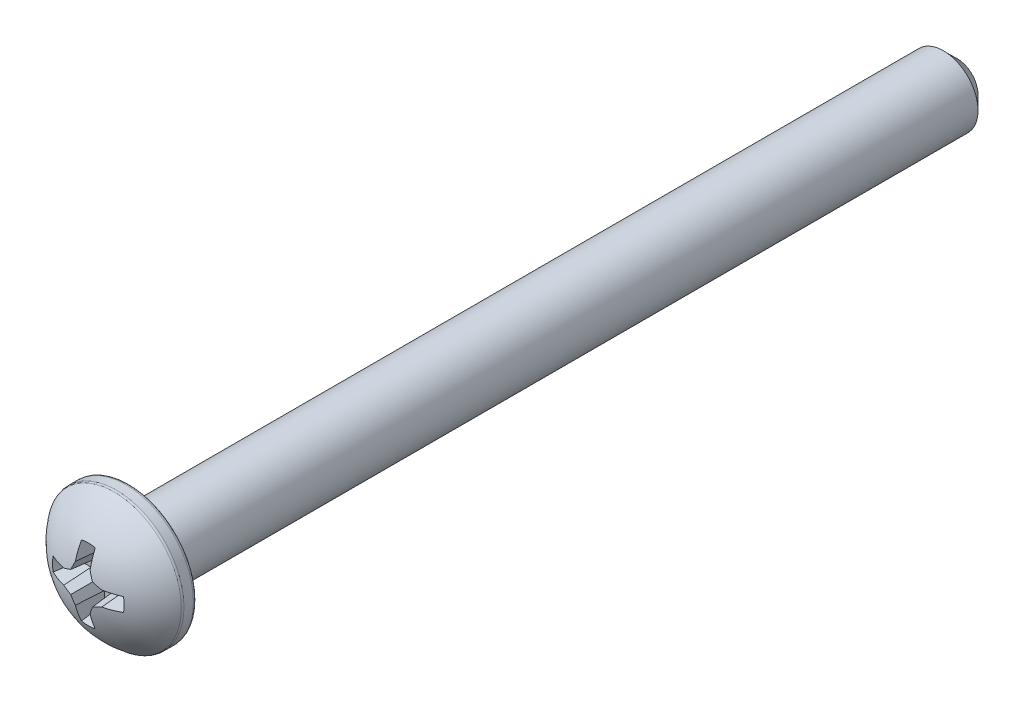
ISO-10303-21;
HEADER;
FILE_DESCRIPTION(('STEP AP214'),'2;1');
FILE_NAME('part.step','',(''),(''),'','','');
FILE_SCHEMA(('AUTOMOTIVE_DESIGN { 1 0 10303 214 1 1 1 1 }'));
ENDSEC;
DATA;
#1=APPLICATION_CONTEXT('core data for automotive mechanical design processes');
#2=APPLICATION_PROTOCOL_DEFINITION('international standard','automotive_design',2000,#1);
#3=PRODUCT_CONTEXT('',#1,'mechanical');
#4=PRODUCT('Part','Part','',(#3));
#5=PRODUCT_RELATED_PRODUCT_CATEGORY('part','',(#4));
#6=PRODUCT_DEFINITION_FORMATION('','',#4);
#7=PRODUCT_DEFINITION_CONTEXT('part definition',#1,'design');
#8=PRODUCT_DEFINITION('design','',#6,#7);
#9=PRODUCT_DEFINITION_SHAPE('','',#8);
#10=(LENGTH_UNIT() NAMED_UNIT(*) SI_UNIT(.MILLI.,.METRE.));
#11=(NAMED_UNIT(*) PLANE_ANGLE_UNIT() SI_UNIT($,.RADIAN.));
#12=(NAMED_UNIT(*) SI_UNIT($,.STERADIAN.) SOLID_ANGLE_UNIT());
#13=UNCERTAINTY_MEASURE_WITH_UNIT(LENGTH_MEASURE(1.E-05),#10,'distance_accuracy_value','');
#14=(GEOMETRIC_REPRESENTATION_CONTEXT(3) GLOBAL_UNCERTAINTY_ASSIGNED_CONTEXT((#13)) GLOBAL_UNIT_ASSIGNED_CONTEXT((#10,
#11,#12)) REPRESENTATION_CONTEXT('',''));
#15=CARTESIAN_POINT('',(0.,0.,0.));
#16=DIRECTION('',(0.,0.,1.));
#17=DIRECTION('',(1.,0.,0.));
#18=AXIS2_PLACEMENT_3D('',#15,#16,#17);
#19=CARTESIAN_POINT('',(0.,0.,-20.1803));
#20=DIRECTION('',(0.,0.,1.));
#21=DIRECTION('',(1.,0.,0.));
#22=AXIS2_PLACEMENT_3D('',#19,#20,#21);
#23=PLANE('',#22);
#24=CARTESIAN_POINT('',(0.,0.,-20.1803));
#25=DIRECTION('',(0.,0.,1.));
#26=DIRECTION('',(1.,0.,0.));
#27=AXIS2_PLACEMENT_3D('',#24,#25,#26);
#28=CIRCLE('',#27,0.952500000000011);
#29=CARTESIAN_POINT('',(0.952500000000011,0.,-20.1803));
#30=VERTEX_POINT('',#29);
#31=EDGE_CURVE('E510',#30,#30,#28,.T.);
#32=ORIENTED_EDGE('',*,*,#31,.F.);
#33=EDGE_LOOP('',(#32));
#34=FACE_BOUND('',#33,.T.);
#35=ADVANCED_FACE('F39',(#34),#23,.F.);
#36=CARTESIAN_POINT('',(0.,0.,-20.1803));
#37=DIRECTION('',(0.,0.,1.));
#38=DIRECTION('',(1.,0.,0.));
#39=AXIS2_PLACEMENT_3D('',#36,#37,#38);
#40=CONICAL_SURFACE('',#39,0.952500000000011,0.785398163397444);
#41=CARTESIAN_POINT('',(0.,0.,-19.5453));
#42=DIRECTION('',(0.,0.,1.));
#43=DIRECTION('',(1.,0.,0.));
#44=AXIS2_PLACEMENT_3D('',#41,#42,#43);
#45=CIRCLE('',#44,1.5875);
#46=CARTESIAN_POINT('',(1.5875,0.,-19.5453));
#47=VERTEX_POINT('',#46);
#48=EDGE_CURVE('E512',#47,#47,#45,.T.);
#49=ORIENTED_EDGE('',*,*,#48,.F.);
#50=EDGE_LOOP('',(#49));
#51=FACE_BOUND('',#50,.T.);
#52=ORIENTED_EDGE('',*,*,#31,.T.);
#53=EDGE_LOOP('',(#52));
#54=FACE_BOUND('',#53,.T.);
#55=ADVANCED_FACE('F380',(#51,#54),#40,.T.);
#56=CARTESIAN_POINT('',(0.,0.,20.1803));
#57=DIRECTION('',(0.,0.,1.));
#58=DIRECTION('',(1.,0.,0.));
#59=AXIS2_PLACEMENT_3D('',#56,#57,#58);
#60=CYLINDRICAL_SURFACE('',#59,1.5875);
#61=CARTESIAN_POINT('',(0.,0.,17.9197));
#62=DIRECTION('',(0.,0.,1.));
#63=DIRECTION('',(1.,0.,0.));
#64=AXIS2_PLACEMENT_3D('',#61,#62,#63);
#65=CIRCLE('',#64,1.5875);
#66=CARTESIAN_POINT('',(1.5875,0.,17.9197));
#67=VERTEX_POINT('',#66);
#68=EDGE_CURVE('E515',#67,#67,#65,.T.);
#69=ORIENTED_EDGE('',*,*,#68,.F.);
#70=EDGE_LOOP('',(#69));
#71=FACE_BOUND('',#70,.T.);
#72=ORIENTED_EDGE('',*,*,#48,.T.);
#73=EDGE_LOOP('',(#72));
#74=FACE_BOUND('',#73,.T.);
#75=ADVANCED_FACE('F385',(#71,#74),#60,.T.);
#76=CARTESIAN_POINT('',(0.,1.5875,17.9197));
#77=DIRECTION('',(0.,0.,1.));
#78=DIRECTION('',(1.,0.,0.));
#79=AXIS2_PLACEMENT_3D('',#76,#77,#78);
#80=PLANE('',#79);
#81=CARTESIAN_POINT('',(0.,0.,17.9197));
#82=DIRECTION('',(0.,0.,1.));
#83=DIRECTION('',(1.,0.,0.));
#84=AXIS2_PLACEMENT_3D('',#81,#82,#83);
#85=CIRCLE('',#84,2.95002857142858);
#86=CARTESIAN_POINT('',(2.95002857142858,0.,17.9197));
#87=VERTEX_POINT('',#86);
#88=EDGE_CURVE('E520',#87,#87,#85,.T.);
#89=ORIENTED_EDGE('',*,*,#88,.F.);
#90=EDGE_LOOP('',(#89));
#91=FACE_BOUND('',#90,.T.);
#92=ORIENTED_EDGE('',*,*,#68,.T.);
#93=EDGE_LOOP('',(#92));
#94=FACE_BOUND('',#93,.T.);
#95=ADVANCED_FACE('F392',(#91,#94),#80,.F.);
#96=CARTESIAN_POINT('',(0.,0.,18.0811714285714));
#97=DIRECTION('',(0.,0.,1.));
#98=DIRECTION('',(1.,0.,0.));
#99=AXIS2_PLACEMENT_3D('',#96,#97,#98);
#100=TOROIDAL_SURFACE('',#99,2.95002857142858,0.161471428571425);
#101=CARTESIAN_POINT('',(0.,0.,18.0811714285714));
#102=DIRECTION('',(0.,0.,1.));
#103=DIRECTION('',(1.,0.,0.));
#104=AXIS2_PLACEMENT_3D('',#101,#102,#103);
#105=CIRCLE('',#104,3.1115);
#106=CARTESIAN_POINT('',(3.1115,0.,18.0811714285714));
#107=VERTEX_POINT('',#106);
#108=EDGE_CURVE('E523',#107,#107,#105,.T.);
#109=ORIENTED_EDGE('',*,*,#108,.F.);
#110=EDGE_LOOP('',(#109));
#111=FACE_BOUND('',#110,.T.);
#112=ORIENTED_EDGE('',*,*,#88,.T.);
#113=EDGE_LOOP('',(#112));
#114=FACE_BOUND('',#113,.T.);
#115=ADVANCED_FACE('F396',(#111,#114),#100,.T.);
#116=CARTESIAN_POINT('',(0.,0.,20.1803));
#117=DIRECTION('',(0.,0.,1.));
#118=DIRECTION('',(1.,0.,0.));
#119=AXIS2_PLACEMENT_3D('',#116,#117,#118);
#120=CYLINDRICAL_SURFACE('',#119,3.1115);
#121=CARTESIAN_POINT('',(0.,0.,18.5138366678697));
#122=DIRECTION('',(0.,0.,1.));
#123=DIRECTION('',(1.,0.,0.));
#124=AXIS2_PLACEMENT_3D('',#121,#122,#123);
#125=CIRCLE('',#124,3.1115);
#126=CARTESIAN_POINT('',(3.1115,0.,18.5138366678697));
#127=VERTEX_POINT('',#126);
#128=EDGE_CURVE('E526',#127,#127,#125,.T.);
#129=ORIENTED_EDGE('',*,*,#128,.F.);
#130=EDGE_LOOP('',(#129));
#131=FACE_BOUND('',#130,.T.);
#132=ORIENTED_EDGE('',*,*,#108,.T.);
#133=EDGE_LOOP('',(#132));
#134=FACE_BOUND('',#133,.T.);
#135=ADVANCED_FACE('F400',(#131,#134),#120,.T.);
#136=CARTESIAN_POINT('',(0.,0.,18.5138366678697));
#137=DIRECTION('',(0.,0.,1.));
#138=DIRECTION('',(1.,0.,0.));
#139=AXIS2_PLACEMENT_3D('',#136,#137,#138);
#140=TOROIDAL_SURFACE('',#139,2.95002857142858,0.161471428571425);
#141=CARTESIAN_POINT('',(0.,0.,18.6086151864584));
#142=DIRECTION('',(0.,0.,1.));
#143=DIRECTION('',(1.,0.,0.));
#144=AXIS2_PLACEMENT_3D('',#141,#142,#143);
#145=CIRCLE('',#144,3.08075750724245);
#146=CARTESIAN_POINT('',(3.08075750724245,0.,18.6086151864584));
#147=VERTEX_POINT('',#146);
#148=EDGE_CURVE('E217',#147,#147,#145,.T.);
#149=ORIENTED_EDGE('',*,*,#148,.F.);
#150=EDGE_LOOP('',(#149));
#151=FACE_BOUND('',#150,.T.);
#152=ORIENTED_EDGE('',*,*,#128,.T.);
#153=EDGE_LOOP('',(#152));
#154=FACE_BOUND('',#153,.T.);
#155=ADVANCED_FACE('F404',(#151,#154),#140,.T.);
#156=CARTESIAN_POINT('',(0.,0.,16.3750650481541));
#157=DIRECTION('',(0.,0.,1.));
#158=DIRECTION('',(0.,1.,0.));
#159=AXIS2_PLACEMENT_3D('',#156,#157,#158);
#160=SPHERICAL_SURFACE('',#159,3.8052349518459);
#161=CARTESIAN_POINT('',(0.,0.0169552992858579,16.3735816516799));
#162=DIRECTION('',(0.,-0.996194698091746,0.0871557427476584));
#163=DIRECTION('',(0.,-0.0871557427476584,-0.996194698091746));
#164=AXIS2_PLACEMENT_3D('',#161,#162,#163);
#165=CIRCLE('',#164,3.80519688795609);
#166=CARTESIAN_POINT('',(-1.6184832889578,0.317105748256313,19.8043169821095));
#167=VERTEX_POINT('',#166);
#168=CARTESIAN_POINT('',(-0.872962105006004,0.339754810015824,20.0631969426292));
#169=VERTEX_POINT('',#168);
#170=EDGE_CURVE('E230',#167,#169,#165,.F.);
#171=ORIENTED_EDGE('',*,*,#170,.T.);
#172=CARTESIAN_POINT('',(-0.123537853912349,0.298246762381666,16.3468219604749));
#173=DIRECTION('',(0.381227206369648,-0.920363891963227,0.0871557427476584));
#174=DIRECTION('',(0.923879532511289,0.382683432365084,0.));
#175=AXIS2_PLACEMENT_3D('',#172,#173,#174);
#176=CIRCLE('',#175,3.79141169409596);
#177=CARTESIAN_POINT('',(-0.499342790609114,0.499342790609112,20.1141995193497));
#178=VERTEX_POINT('',#177);
#179=EDGE_CURVE('E11',#169,#178,#176,.F.);
#180=ORIENTED_EDGE('',*,*,#179,.T.);
#181=CARTESIAN_POINT('',(-0.298246762381666,0.12353785391235,16.3468219604749));
#182=DIRECTION('',(0.920363891963228,-0.381227206369646,0.0871557427476584));
#183=DIRECTION('',(0.382683432365082,0.92387953251129,0.));
#184=AXIS2_PLACEMENT_3D('',#181,#182,#183);
#185=CIRCLE('',#184,3.79141169409596);
#186=CARTESIAN_POINT('',(-0.339754810015826,0.872962105006002,20.0631969426292));
#187=VERTEX_POINT('',#186);
#188=EDGE_CURVE('E49',#178,#187,#185,.F.);
#189=ORIENTED_EDGE('',*,*,#188,.T.);
#190=CARTESIAN_POINT('',(-0.0169552992858607,0.,16.3735816516799));
#191=DIRECTION('',(0.996194698091746,0.,0.0871557427476584));
#192=DIRECTION('',(0.0871557427476584,0.,-0.996194698091746));
#193=AXIS2_PLACEMENT_3D('',#190,#191,#192);
#194=CIRCLE('',#193,3.80519688795609);
#195=CARTESIAN_POINT('',(-0.317105748256316,1.6184832889578,19.8043169821095));
#196=VERTEX_POINT('',#195);
#197=EDGE_CURVE('E342',#187,#196,#194,.F.);
#198=ORIENTED_EDGE('',*,*,#197,.T.);
#199=CARTESIAN_POINT('',(0.,0.,19.8043169821095));
#200=DIRECTION('',(0.,0.,-1.));
#201=DIRECTION('',(-1.,0.,0.));
#202=AXIS2_PLACEMENT_3D('',#199,#200,#201);
#203=CIRCLE('',#202,1.64925565398844);
#204=CARTESIAN_POINT('',(0.317105748256316,1.6184832889578,19.8043169821095));
#205=VERTEX_POINT('',#204);
#206=EDGE_CURVE('E341',#196,#205,#203,.T.);
#207=ORIENTED_EDGE('',*,*,#206,.T.);
#208=CARTESIAN_POINT('',(0.0169552992858607,0.,16.3735816516799));
#209=DIRECTION('',(-0.996194698091746,0.,0.0871557427476584));
#210=DIRECTION('',(0.0871557427476584,0.,0.996194698091746));
#211=AXIS2_PLACEMENT_3D('',#208,#209,#210);
#212=CIRCLE('',#211,3.80519688795609);
#213=CARTESIAN_POINT('',(0.339754810015826,0.872962105006002,20.0631969426292));
#214=VERTEX_POINT('',#213);
#215=EDGE_CURVE('E186',#205,#214,#212,.F.);
#216=ORIENTED_EDGE('',*,*,#215,.T.);
#217=CARTESIAN_POINT('',(0.298246762381666,0.12353785391235,16.3468219604749));
#218=DIRECTION('',(-0.920363891963228,-0.381227206369646,0.0871557427476584));
#219=DIRECTION('',(0.382683432365082,-0.92387953251129,0.));
#220=AXIS2_PLACEMENT_3D('',#217,#218,#219);
#221=CIRCLE('',#220,3.79141169409596);
#222=CARTESIAN_POINT('',(0.499342790609114,0.499342790609112,20.1141995193497));
#223=VERTEX_POINT('',#222);
#224=EDGE_CURVE('E478',#214,#223,#221,.F.);
#225=ORIENTED_EDGE('',*,*,#224,.T.);
#226=CARTESIAN_POINT('',(0.123537853912349,0.298246762381666,16.3468219604749));
#227=DIRECTION('',(-0.381227206369648,-0.920363891963227,0.0871557427476584));
#228=DIRECTION('',(0.923879532511289,-0.382683432365084,0.));
#229=AXIS2_PLACEMENT_3D('',#226,#227,#228);
#230=CIRCLE('',#229,3.79141169409596);
#231=CARTESIAN_POINT('',(0.872962105006004,0.339754810015824,20.0631969426292));
#232=VERTEX_POINT('',#231);
#233=EDGE_CURVE('E476',#223,#232,#230,.F.);
#234=ORIENTED_EDGE('',*,*,#233,.T.);
#235=CARTESIAN_POINT('',(0.,0.0169552992858579,16.3735816516799));
#236=DIRECTION('',(0.,-0.996194698091746,0.0871557427476584));
#237=DIRECTION('',(0.,-0.0871557427476584,-0.996194698091746));
#238=AXIS2_PLACEMENT_3D('',#235,#236,#237);
#239=CIRCLE('',#238,3.80519688795609);
#240=CARTESIAN_POINT('',(1.6184832889578,0.317105748256313,19.8043169821095));
#241=VERTEX_POINT('',#240);
#242=EDGE_CURVE('E475',#232,#241,#239,.F.);
#243=ORIENTED_EDGE('',*,*,#242,.T.);
#244=CARTESIAN_POINT('',(0.,0.,19.8043169821095));
#245=DIRECTION('',(0.,0.,-1.));
#246=DIRECTION('',(-1.,0.,0.));
#247=AXIS2_PLACEMENT_3D('',#244,#245,#246);
#248=CIRCLE('',#247,1.64925565398844);
#249=CARTESIAN_POINT('',(1.6184832889578,-0.317105748256313,19.8043169821095));
#250=VERTEX_POINT('',#249);
#251=EDGE_CURVE('E291',#241,#250,#248,.T.);
#252=ORIENTED_EDGE('',*,*,#251,.T.);
#253=CARTESIAN_POINT('',(0.,-0.0169552992858579,16.3735816516799));
#254=DIRECTION('',(0.,0.996194698091746,0.0871557427476584));
#255=DIRECTION('',(0.,-0.0871557427476584,0.996194698091746));
#256=AXIS2_PLACEMENT_3D('',#253,#254,#255);
#257=CIRCLE('',#256,3.80519688795609);
#258=CARTESIAN_POINT('',(0.872962105006004,-0.339754810015824,20.0631969426292));
#259=VERTEX_POINT('',#258);
#260=EDGE_CURVE('E288',#250,#259,#257,.F.);
#261=ORIENTED_EDGE('',*,*,#260,.T.);
#262=CARTESIAN_POINT('',(0.12353785391235,-0.298246762381665,16.3468219604749));
#263=DIRECTION('',(-0.381227206369648,0.920363891963227,0.0871557427476584));
#264=DIRECTION('',(-0.923879532511289,-0.382683432365084,0.));
#265=AXIS2_PLACEMENT_3D('',#262,#263,#264);
#266=CIRCLE('',#265,3.79141169409596);
#267=CARTESIAN_POINT('',(0.499342790609114,-0.499342790609112,20.1141995193497));
#268=VERTEX_POINT('',#267);
#269=EDGE_CURVE('E292',#259,#268,#266,.F.);
#270=ORIENTED_EDGE('',*,*,#269,.T.);
#271=CARTESIAN_POINT('',(0.298246762381667,-0.123537853912348,16.3468219604749));
#272=DIRECTION('',(-0.920363891963228,0.381227206369646,0.0871557427476584));
#273=DIRECTION('',(-0.382683432365082,-0.92387953251129,0.));
#274=AXIS2_PLACEMENT_3D('',#271,#272,#273);
#275=CIRCLE('',#274,3.79141169409596);
#276=CARTESIAN_POINT('',(0.339754810015826,-0.872962105006002,20.0631969426292));
#277=VERTEX_POINT('',#276);
#278=EDGE_CURVE('E295',#268,#277,#275,.F.);
#279=ORIENTED_EDGE('',*,*,#278,.T.);
#280=CARTESIAN_POINT('',(0.0169552992858607,0.,16.3735816516799));
#281=DIRECTION('',(-0.996194698091746,0.,0.0871557427476584));
#282=DIRECTION('',(0.0871557427476584,0.,0.996194698091746));
#283=AXIS2_PLACEMENT_3D('',#280,#281,#282);
#284=CIRCLE('',#283,3.80519688795609);
#285=CARTESIAN_POINT('',(0.317105748256316,-1.61848328895779,19.8043169821095));
#286=VERTEX_POINT('',#285);
#287=EDGE_CURVE('E298',#277,#286,#284,.F.);
#288=ORIENTED_EDGE('',*,*,#287,.T.);
#289=CARTESIAN_POINT('',(0.,0.,19.8043169821095));
#290=DIRECTION('',(0.,0.,-1.));
#291=DIRECTION('',(-1.,0.,0.));
#292=AXIS2_PLACEMENT_3D('',#289,#290,#291);
#293=CIRCLE('',#292,1.64925565398844);
#294=CARTESIAN_POINT('',(-0.317105748256316,-1.61848328895779,19.8043169821095));
#295=VERTEX_POINT('',#294);
#296=EDGE_CURVE('E301',#286,#295,#293,.T.);
#297=ORIENTED_EDGE('',*,*,#296,.T.);
#298=CARTESIAN_POINT('',(-0.0169552992858607,0.,16.3735816516799));
#299=DIRECTION('',(0.996194698091746,0.,0.0871557427476584));
#300=DIRECTION('',(0.0871557427476584,0.,-0.996194698091746));
#301=AXIS2_PLACEMENT_3D('',#298,#299,#300);
#302=CIRCLE('',#301,3.80519688795609);
#303=CARTESIAN_POINT('',(-0.339754810015826,-0.872962105006002,20.0631969426292));
#304=VERTEX_POINT('',#303);
#305=EDGE_CURVE('E337',#295,#304,#302,.F.);
#306=ORIENTED_EDGE('',*,*,#305,.T.);
#307=CARTESIAN_POINT('',(-0.298246762381667,-0.123537853912348,16.3468219604749));
#308=DIRECTION('',(0.920363891963228,0.381227206369646,0.0871557427476584));
#309=DIRECTION('',(-0.382683432365082,0.92387953251129,0.));
#310=AXIS2_PLACEMENT_3D('',#307,#308,#309);
#311=CIRCLE('',#310,3.79141169409596);
#312=CARTESIAN_POINT('',(-0.499342790609114,-0.499342790609112,20.1141995193497));
#313=VERTEX_POINT('',#312);
#314=EDGE_CURVE('E446',#304,#313,#311,.F.);
#315=ORIENTED_EDGE('',*,*,#314,.T.);
#316=CARTESIAN_POINT('',(-0.12353785391235,-0.298246762381665,16.3468219604749));
#317=DIRECTION('',(0.381227206369648,0.920363891963227,0.0871557427476584));
#318=DIRECTION('',(-0.923879532511289,0.382683432365084,0.));
#319=AXIS2_PLACEMENT_3D('',#316,#317,#318);
#320=CIRCLE('',#319,3.79141169409596);
#321=CARTESIAN_POINT('',(-0.872962105006004,-0.339754810015824,20.0631969426292));
#322=VERTEX_POINT('',#321);
#323=EDGE_CURVE('E448',#313,#322,#320,.F.);
#324=ORIENTED_EDGE('',*,*,#323,.T.);
#325=CARTESIAN_POINT('',(0.,-0.0169552992858579,16.3735816516799));
#326=DIRECTION('',(0.,0.996194698091746,0.0871557427476584));
#327=DIRECTION('',(0.,-0.0871557427476584,0.996194698091746));
#328=AXIS2_PLACEMENT_3D('',#325,#326,#327);
#329=CIRCLE('',#328,3.80519688795609);
#330=CARTESIAN_POINT('',(-1.6184832889578,-0.317105748256313,19.8043169821095));
#331=VERTEX_POINT('',#330);
#332=EDGE_CURVE('E259',#322,#331,#329,.F.);
#333=ORIENTED_EDGE('',*,*,#332,.T.);
#334=CARTESIAN_POINT('',(0.,0.,19.8043169821095));
#335=DIRECTION('',(0.,0.,-1.));
#336=DIRECTION('',(-1.,0.,0.));
#337=AXIS2_PLACEMENT_3D('',#334,#335,#336);
#338=CIRCLE('',#337,1.64925565398844);
#339=EDGE_CURVE('E328',#331,#167,#338,.T.);
#340=ORIENTED_EDGE('',*,*,#339,.T.);
#341=EDGE_LOOP('',(#171,#180,#189,#198,#207,#216,#225,#234,#243,#252,#261,#270,#279,#288,#297,
#306,#315,#324,#333,#340));
#342=FACE_BOUND('',#341,.T.);
#343=ORIENTED_EDGE('',*,*,#148,.T.);
#344=EDGE_LOOP('',(#343));
#345=FACE_BOUND('',#344,.T.);
#346=ADVANCED_FACE('F408',(#342,#345),#160,.T.);
#347=CARTESIAN_POINT('',(-0.251884469938526,0.608102903476759,20.1803));
#348=DIRECTION('',(0.381227206369648,-0.920363891963227,0.0871557427476584));
#349=DIRECTION('',(0.923879532511289,0.382683432365084,0.));
#350=AXIS2_PLACEMENT_3D('',#347,#348,#349);
#351=PLANE('',#350);
#352=DIRECTION('',(-0.0173337504938599,0.0871426484044397,0.996045029063886));
#353=VECTOR('',#352,1.);
#354=CARTESIAN_POINT('',(-0.8747370984571,0.348678304690782,20.1651929534874));
#355=LINE('',#354,#353);
#356=CARTESIAN_POINT('',(-0.851395840415028,0.231333876339974,18.82394));
#357=VERTEX_POINT('',#356);
#358=EDGE_CURVE('E58',#357,#169,#355,.T.);
#359=ORIENTED_EDGE('',*,*,#358,.F.);
#360=DIRECTION('',(0.923879532511289,0.382683432365084,0.));
#361=VECTOR('',#360,1.);
#362=CARTESIAN_POINT('',(-0.206472910430849,0.498469700624811,18.82394));
#363=LINE('',#362,#361);
#364=CARTESIAN_POINT('',(-0.412945820861707,0.412945820861705,18.82394));
#365=VERTEX_POINT('',#364);
#366=EDGE_CURVE('E426',#365,#357,#363,.F.);
#367=ORIENTED_EDGE('',*,*,#366,.F.);
#368=DIRECTION('',(-0.0666626913468326,0.0666626913468325,0.995546167269401));
#369=VECTOR('',#368,1.);
#370=CARTESIAN_POINT('',(-0.503113238054619,0.503113238054617,20.1705076945437));
#371=LINE('',#370,#369);
#372=EDGE_CURVE('E214',#365,#178,#371,.T.);
#373=ORIENTED_EDGE('',*,*,#372,.T.);
#374=ORIENTED_EDGE('',*,*,#179,.F.);
#375=EDGE_LOOP('',(#359,#367,#373,#374));
#376=FACE_BOUND('',#375,.T.);
#377=ADVANCED_FACE('F377',(#376),#351,.T.);
#378=CARTESIAN_POINT('',(-0.60810290347676,0.251884469938525,20.1803));
#379=DIRECTION('',(0.920363891963228,-0.381227206369646,0.0871557427476584));
#380=DIRECTION('',(0.382683432365082,0.92387953251129,0.));
#381=AXIS2_PLACEMENT_3D('',#378,#379,#380);
#382=PLANE('',#381);
#383=ORIENTED_EDGE('',*,*,#372,.F.);
#384=DIRECTION('',(0.382683432365082,0.92387953251129,0.));
#385=VECTOR('',#384,1.);
#386=CARTESIAN_POINT('',(-0.498469700624811,0.206472910430849,18.82394));
#387=LINE('',#386,#385);
#388=CARTESIAN_POINT('',(-0.231333876339977,0.851395840415026,18.82394));
#389=VERTEX_POINT('',#388);
#390=EDGE_CURVE('E213',#389,#365,#387,.F.);
#391=ORIENTED_EDGE('',*,*,#390,.F.);
#392=DIRECTION('',(-0.0871426484044397,0.0173337504938599,0.996045029063886));
#393=VECTOR('',#392,1.);
#394=CARTESIAN_POINT('',(-0.351018770885411,0.875202646128642,20.1919446045048));
#395=LINE('',#394,#393);
#396=EDGE_CURVE('E218',#389,#187,#395,.T.);
#397=ORIENTED_EDGE('',*,*,#396,.T.);
#398=ORIENTED_EDGE('',*,*,#188,.F.);
#399=EDGE_LOOP('',(#383,#391,#397,#398));
#400=FACE_BOUND('',#399,.T.);
#401=ADVANCED_FACE('F41',(#400),#382,.T.);
#402=CARTESIAN_POINT('',(-0.35,0.,20.1803));
#403=DIRECTION('',(0.996194698091746,0.,0.0871557427476584));
#404=DIRECTION('',(0.0871557427476584,0.,-0.996194698091746));
#405=AXIS2_PLACEMENT_3D('',#402,#403,#404);
#406=PLANE('',#405);
#407=ORIENTED_EDGE('',*,*,#396,.F.);
#408=DIRECTION('',(0.,1.,0.));
#409=VECTOR('',#408,1.);
#410=CARTESIAN_POINT('',(-0.231333876339977,0.,18.82394));
#411=LINE('',#410,#409);
#412=CARTESIAN_POINT('',(-0.231333876339977,1.36713041276252,18.82394));
#413=VERTEX_POINT('',#412);
#414=EDGE_CURVE('E199',#413,#389,#411,.F.);
#415=ORIENTED_EDGE('',*,*,#414,.F.);
#416=CARTESIAN_POINT('',(-0.317105748256316,1.6184832889578,19.8043169821095));
#417=CARTESIAN_POINT('',(-0.298664238672416,1.56453938751293,19.5935295630237));
#418=CARTESIAN_POINT('',(-0.280223757893741,1.51054909754499,19.3827539032353));
#419=CARTESIAN_POINT('',(-0.24334602956208,1.40242430739939,18.9612395395974));
#420=CARTESIAN_POINT('',(-0.224908782005677,1.34828980737506,18.7505008357088));
#421=CARTESIAN_POINT('',(-0.188038642941042,1.23982500953389,18.3290732177899));
#422=CARTESIAN_POINT('',(-0.16960575143603,1.18549471157279,18.1183843037965));
#423=CARTESIAN_POINT('',(-0.132746916017072,1.0765239045036,17.6970858871389));
#424=CARTESIAN_POINT('',(-0.114320972110771,1.02188339505522,17.4864763845622));
#425=CARTESIAN_POINT('',(-0.0958998112074285,0.967030612768108,17.2759215519594));
#426=B_SPLINE_CURVE_WITH_KNOTS('',3,(#416,#417,#418,#419,#420,#421,#422,#423,#424,#425),
.UNSPECIFIED.,.F.,.F.,(4,2,2,2,4),(0.,0.655081945327905,1.31016319440927,1.96524492630309,
2.62032737695616),.UNSPECIFIED.);
#427=EDGE_CURVE('E189',#413,#196,#426,.F.);
#428=ORIENTED_EDGE('',*,*,#427,.T.);
#429=ORIENTED_EDGE('',*,*,#197,.F.);
#430=EDGE_LOOP('',(#407,#415,#428,#429));
#431=FACE_BOUND('',#430,.T.);
#432=ADVANCED_FACE('F360',(#431),#406,.T.);
#433=CARTESIAN_POINT('',(0.,0.,20.1803));
#434=DIRECTION('',(0.,0.,1.));
#435=DIRECTION('',(1.,0.,0.));
#436=AXIS2_PLACEMENT_3D('',#433,#434,#435);
#437=CONICAL_SURFACE('',#436,1.75000000000002,0.26179938779915);
#438=ORIENTED_EDGE('',*,*,#427,.F.);
#439=CARTESIAN_POINT('',(0.,0.,18.82394));
#440=DIRECTION('',(0.,0.,-1.));
#441=DIRECTION('',(-1.,0.,0.));
#442=AXIS2_PLACEMENT_3D('',#439,#440,#441);
#443=CIRCLE('',#442,1.38656443335414);
#444=CARTESIAN_POINT('',(0.231333876339977,1.36713041276252,18.82394));
#445=VERTEX_POINT('',#444);
#446=EDGE_CURVE('E193',#445,#413,#443,.F.);
#447=ORIENTED_EDGE('',*,*,#446,.F.);
#448=CARTESIAN_POINT('',(0.0997371480004089,0.978456524847293,17.3197825122065));
#449=CARTESIAN_POINT('',(0.121708972408318,1.04383178898208,17.5709216143759));
#450=CARTESIAN_POINT('',(0.143687102872801,1.10892681426751,17.8221327951019));
#451=CARTESIAN_POINT('',(0.187652260914244,1.23871930343197,18.3246568510148));
#452=CARTESIAN_POINT('',(0.209639288482759,1.30341676768739,18.5759697261051));
#453=CARTESIAN_POINT('',(0.245891571910277,1.40988417204671,18.9903352217762));
#454=CARTESIAN_POINT('',(0.26015531469252,1.45172204240851,19.1533705478104));
#455=CARTESIAN_POINT('',(0.30354486567173,1.57886513479211,19.6493153848961));
#456=CARTESIAN_POINT('',(0.332673405631292,1.66404763239739,19.9822561201369));
#457=CARTESIAN_POINT('',(0.390935126555155,1.83420268507318,20.6481906375456));
#458=CARTESIAN_POINT('',(0.420068307516812,1.91917524026284,20.9811844196831));
#459=CARTESIAN_POINT('',(0.449202552172679,2.00409935466839,21.3141903599011));
#460=B_SPLINE_CURVE_WITH_KNOTS('',3,(#448,#449,#450,#451,#452,#453,#454,#455,#456,#457,#458,
#459),.UNSPECIFIED.,.F.,.F.,(4,2,2,2,2,4),(0.,0.781311006817636,1.56262127382759,
2.06938493485055,3.10407635890297,4.13876719567384),.UNSPECIFIED.);
#461=EDGE_CURVE('E178',#445,#205,#460,.T.);
#462=ORIENTED_EDGE('',*,*,#461,.T.);
#463=ORIENTED_EDGE('',*,*,#206,.F.);
#464=EDGE_LOOP('',(#438,#447,#462,#463));
#465=FACE_BOUND('',#464,.T.);
#466=ADVANCED_FACE('F194',(#465),#437,.F.);
#467=CARTESIAN_POINT('',(0.35,0.,20.1803));
#468=DIRECTION('',(-0.996194698091746,0.,0.0871557427476584));
#469=DIRECTION('',(0.0871557427476584,0.,0.996194698091746));
#470=AXIS2_PLACEMENT_3D('',#467,#468,#469);
#471=PLANE('',#470);
#472=ORIENTED_EDGE('',*,*,#461,.F.);
#473=DIRECTION('',(0.,-1.,0.));
#474=VECTOR('',#473,1.);
#475=CARTESIAN_POINT('',(0.231333876339977,0.,18.82394));
#476=LINE('',#475,#474);
#477=CARTESIAN_POINT('',(0.231333876339977,0.851395840415026,18.82394));
#478=VERTEX_POINT('',#477);
#479=EDGE_CURVE('E183',#478,#445,#476,.F.);
#480=ORIENTED_EDGE('',*,*,#479,.F.);
#481=DIRECTION('',(0.0871426484044397,0.0173337504938599,0.996045029063886));
#482=VECTOR('',#481,1.);
#483=CARTESIAN_POINT('',(0.348678304690785,0.874737098457097,20.1651929534874));
#484=LINE('',#483,#482);
#485=EDGE_CURVE('E190',#478,#214,#484,.T.);
#486=ORIENTED_EDGE('',*,*,#485,.T.);
#487=ORIENTED_EDGE('',*,*,#215,.F.);
#488=EDGE_LOOP('',(#472,#480,#486,#487));
#489=FACE_BOUND('',#488,.T.);
#490=ADVANCED_FACE('F180',(#489),#471,.T.);
#491=CARTESIAN_POINT('',(0.60810290347676,0.251884469938525,20.1803));
#492=DIRECTION('',(-0.920363891963228,-0.381227206369646,0.0871557427476584));
#493=DIRECTION('',(0.382683432365082,-0.92387953251129,0.));
#494=AXIS2_PLACEMENT_3D('',#491,#492,#493);
#495=PLANE('',#494);
#496=ORIENTED_EDGE('',*,*,#485,.F.);
#497=DIRECTION('',(0.382683432365082,-0.92387953251129,0.));
#498=VECTOR('',#497,1.);
#499=CARTESIAN_POINT('',(0.498469700624811,0.206472910430849,18.82394));
#500=LINE('',#499,#498);
#501=CARTESIAN_POINT('',(0.412945820861707,0.412945820861705,18.82394));
#502=VERTEX_POINT('',#501);
#503=EDGE_CURVE('E205',#502,#478,#500,.F.);
#504=ORIENTED_EDGE('',*,*,#503,.F.);
#505=DIRECTION('',(0.0666626913468326,0.0666626913468325,0.995546167269401));
#506=VECTOR('',#505,1.);
#507=CARTESIAN_POINT('',(0.503113238054619,0.503113238054617,20.1705076945437));
#508=LINE('',#507,#506);
#509=EDGE_CURVE('E345',#502,#223,#508,.T.);
#510=ORIENTED_EDGE('',*,*,#509,.T.);
#511=ORIENTED_EDGE('',*,*,#224,.F.);
#512=EDGE_LOOP('',(#496,#504,#510,#511));
#513=FACE_BOUND('',#512,.T.);
#514=ADVANCED_FACE('F494',(#513),#495,.T.);
#515=CARTESIAN_POINT('',(0.251884469938526,0.608102903476759,20.1803));
#516=DIRECTION('',(-0.381227206369648,-0.920363891963227,0.0871557427476584));
#517=DIRECTION('',(0.923879532511289,-0.382683432365084,0.));
#518=AXIS2_PLACEMENT_3D('',#515,#516,#517);
#519=PLANE('',#518);
#520=ORIENTED_EDGE('',*,*,#509,.F.);
#521=DIRECTION('',(0.923879532511289,-0.382683432365084,0.));
#522=VECTOR('',#521,1.);
#523=CARTESIAN_POINT('',(0.206472910430849,0.498469700624811,18.82394));
#524=LINE('',#523,#522);
#525=CARTESIAN_POINT('',(0.851395840415028,0.231333876339974,18.82394));
#526=VERTEX_POINT('',#525);
#527=EDGE_CURVE('E207',#526,#502,#524,.F.);
#528=ORIENTED_EDGE('',*,*,#527,.F.);
#529=DIRECTION('',(0.0173337504938599,0.0871426484044397,0.996045029063886));
#530=VECTOR('',#529,1.);
#531=CARTESIAN_POINT('',(0.875202646128645,0.351018770885408,20.1919446045048));
#532=LINE('',#531,#530);
#533=EDGE_CURVE('E348',#526,#232,#532,.T.);
#534=ORIENTED_EDGE('',*,*,#533,.T.);
#535=ORIENTED_EDGE('',*,*,#233,.F.);
#536=EDGE_LOOP('',(#520,#528,#534,#535));
#537=FACE_BOUND('',#536,.T.);
#538=ADVANCED_FACE('F488',(#537),#519,.T.);
#539=CARTESIAN_POINT('',(0.,0.349999999999997,20.1803));
#540=DIRECTION('',(0.,-0.996194698091746,0.0871557427476584));
#541=DIRECTION('',(0.,-0.0871557427476584,-0.996194698091746));
#542=AXIS2_PLACEMENT_3D('',#539,#540,#541);
#543=PLANE('',#542);
#544=ORIENTED_EDGE('',*,*,#533,.F.);
#545=DIRECTION('',(1.,0.,0.));
#546=VECTOR('',#545,1.);
#547=CARTESIAN_POINT('',(0.,0.231333876339974,18.82394));
#548=LINE('',#547,#546);
#549=CARTESIAN_POINT('',(1.36713041276252,0.231333876339974,18.82394));
#550=VERTEX_POINT('',#549);
#551=EDGE_CURVE('E321',#550,#526,#548,.F.);
#552=ORIENTED_EDGE('',*,*,#551,.F.);
#553=CARTESIAN_POINT('',(1.6184832889578,0.317105748256313,19.8043169821095));
#554=CARTESIAN_POINT('',(1.56453938751293,0.298664238672413,19.5935295630236));
#555=CARTESIAN_POINT('',(1.51054909754499,0.280223757893738,19.3827539032353));
#556=CARTESIAN_POINT('',(1.40242430739939,0.243346029562077,18.9612395395974));
#557=CARTESIAN_POINT('',(1.34828980737506,0.224908782005674,18.7505008357088));
#558=CARTESIAN_POINT('',(1.2398250095339,0.188038642941039,18.3290732177899));
#559=CARTESIAN_POINT('',(1.18549471157279,0.169605751436027,18.1183843037965));
#560=CARTESIAN_POINT('',(1.0765239045036,0.132746916017069,17.6970858871389));
#561=CARTESIAN_POINT('',(1.02188339505522,0.114320972110767,17.4864763845622));
#562=CARTESIAN_POINT('',(0.967030612768109,0.0958998112074254,17.2759215519594));
#563=B_SPLINE_CURVE_WITH_KNOTS('',3,(#553,#554,#555,#556,#557,#558,#559,#560,#561,#562),
.UNSPECIFIED.,.F.,.F.,(4,2,2,2,4),(0.,0.655081945327902,1.31016319440927,1.96524492630309,
2.62032737695616),.UNSPECIFIED.);
#564=EDGE_CURVE('E161',#550,#241,#563,.F.);
#565=ORIENTED_EDGE('',*,*,#564,.T.);
#566=ORIENTED_EDGE('',*,*,#242,.F.);
#567=EDGE_LOOP('',(#544,#552,#565,#566));
#568=FACE_BOUND('',#567,.T.);
#569=ADVANCED_FACE('F485',(#568),#543,.T.);
#570=CARTESIAN_POINT('',(0.,0.,20.1803));
#571=DIRECTION('',(0.,0.,1.));
#572=DIRECTION('',(1.,0.,0.));
#573=AXIS2_PLACEMENT_3D('',#570,#571,#572);
#574=CONICAL_SURFACE('',#573,1.75000000000002,0.26179938779915);
#575=ORIENTED_EDGE('',*,*,#564,.F.);
#576=CARTESIAN_POINT('',(0.,0.,18.82394));
#577=DIRECTION('',(0.,0.,-1.));
#578=DIRECTION('',(-1.,0.,0.));
#579=AXIS2_PLACEMENT_3D('',#576,#577,#578);
#580=CIRCLE('',#579,1.38656443335414);
#581=CARTESIAN_POINT('',(1.36713041276252,-0.231333876339974,18.82394));
#582=VERTEX_POINT('',#581);
#583=EDGE_CURVE('E319',#582,#550,#580,.F.);
#584=ORIENTED_EDGE('',*,*,#583,.F.);
#585=CARTESIAN_POINT('',(0.978456524847297,-0.0997371480004067,17.3197825122065));
#586=CARTESIAN_POINT('',(1.04383178898209,-0.121708972408315,17.570921614376));
#587=CARTESIAN_POINT('',(1.10892681426752,-0.143687102872799,17.8221327951019));
#588=CARTESIAN_POINT('',(1.23871930343198,-0.187652260914242,18.3246568510148));
#589=CARTESIAN_POINT('',(1.30341676768739,-0.209639288482758,18.5759697261052));
#590=CARTESIAN_POINT('',(1.40988417204671,-0.245891571910275,18.9903352217762));
#591=CARTESIAN_POINT('',(1.45172204240851,-0.260155314692518,19.1533705478104));
#592=CARTESIAN_POINT('',(1.57886513479212,-0.303544865671727,19.6493153848961));
#593=CARTESIAN_POINT('',(1.66404763239739,-0.332673405631289,19.9822561201369));
#594=CARTESIAN_POINT('',(1.83420268507318,-0.390935126555152,20.6481906375456));
#595=CARTESIAN_POINT('',(1.91917524026284,-0.420068307516809,20.9811844196831));
#596=CARTESIAN_POINT('',(2.00409935466839,-0.449202552172676,21.3141903599011));
#597=B_SPLINE_CURVE_WITH_KNOTS('',3,(#585,#586,#587,#588,#589,#590,#591,#592,#593,#594,#595,
#596),.UNSPECIFIED.,.F.,.F.,(4,2,2,2,2,4),(0.,0.78131100681764,1.56262127382759,
2.06938493485055,3.10407635890295,4.13876719567383),.UNSPECIFIED.);
#598=EDGE_CURVE('E153',#582,#250,#597,.T.);
#599=ORIENTED_EDGE('',*,*,#598,.T.);
#600=ORIENTED_EDGE('',*,*,#251,.F.);
#601=EDGE_LOOP('',(#575,#584,#599,#600));
#602=FACE_BOUND('',#601,.T.);
#603=ADVANCED_FACE('F242',(#602),#574,.F.);
#604=CARTESIAN_POINT('',(0.,-0.349999999999997,20.1803));
#605=DIRECTION('',(0.,0.996194698091746,0.0871557427476584));
#606=DIRECTION('',(0.,-0.0871557427476584,0.996194698091746));
#607=AXIS2_PLACEMENT_3D('',#604,#605,#606);
#608=PLANE('',#607);
#609=ORIENTED_EDGE('',*,*,#598,.F.);
#610=DIRECTION('',(-1.,0.,0.));
#611=VECTOR('',#610,1.);
#612=CARTESIAN_POINT('',(0.,-0.231333876339974,18.82394));
#613=LINE('',#612,#611);
#614=CARTESIAN_POINT('',(0.851395840415028,-0.231333876339974,18.82394));
#615=VERTEX_POINT('',#614);
#616=EDGE_CURVE('E43',#615,#582,#613,.F.);
#617=ORIENTED_EDGE('',*,*,#616,.F.);
#618=DIRECTION('',(0.0173337504938599,-0.0871426484044397,0.996045029063886));
#619=VECTOR('',#618,1.);
#620=CARTESIAN_POINT('',(0.8747370984571,-0.348678304690782,20.1651929534874));
#621=LINE('',#620,#619);
#622=EDGE_CURVE('E147',#615,#259,#621,.T.);
#623=ORIENTED_EDGE('',*,*,#622,.T.);
#624=ORIENTED_EDGE('',*,*,#260,.F.);
#625=EDGE_LOOP('',(#609,#617,#623,#624));
#626=FACE_BOUND('',#625,.T.);
#627=ADVANCED_FACE('F271',(#626),#608,.T.);
#628=CARTESIAN_POINT('',(0.251884469938526,-0.608102903476759,20.1803));
#629=DIRECTION('',(-0.381227206369648,0.920363891963227,0.0871557427476584));
#630=DIRECTION('',(-0.923879532511289,-0.382683432365084,0.));
#631=AXIS2_PLACEMENT_3D('',#628,#629,#630);
#632=PLANE('',#631);
#633=ORIENTED_EDGE('',*,*,#622,.F.);
#634=DIRECTION('',(-0.923879532511289,-0.382683432365084,0.));
#635=VECTOR('',#634,1.);
#636=CARTESIAN_POINT('',(0.206472910430849,-0.498469700624811,18.82394));
#637=LINE('',#636,#635);
#638=CARTESIAN_POINT('',(0.412945820861707,-0.412945820861705,18.82394));
#639=VERTEX_POINT('',#638);
#640=EDGE_CURVE('E316',#639,#615,#637,.F.);
#641=ORIENTED_EDGE('',*,*,#640,.F.);
#642=DIRECTION('',(0.0666626913468326,-0.0666626913468325,0.995546167269401));
#643=VECTOR('',#642,1.);
#644=CARTESIAN_POINT('',(0.503113238054619,-0.503113238054617,20.1705076945437));
#645=LINE('',#644,#643);
#646=EDGE_CURVE('E463',#639,#268,#645,.T.);
#647=ORIENTED_EDGE('',*,*,#646,.T.);
#648=ORIENTED_EDGE('',*,*,#269,.F.);
#649=EDGE_LOOP('',(#633,#641,#647,#648));
#650=FACE_BOUND('',#649,.T.);
#651=ADVANCED_FACE('F275',(#650),#632,.T.);
#652=CARTESIAN_POINT('',(0.60810290347676,-0.251884469938525,20.1803));
#653=DIRECTION('',(-0.920363891963228,0.381227206369646,0.0871557427476584));
#654=DIRECTION('',(-0.382683432365082,-0.92387953251129,0.));
#655=AXIS2_PLACEMENT_3D('',#652,#653,#654);
#656=PLANE('',#655);
#657=ORIENTED_EDGE('',*,*,#646,.F.);
#658=DIRECTION('',(-0.382683432365082,-0.92387953251129,0.));
#659=VECTOR('',#658,1.);
#660=CARTESIAN_POINT('',(0.498469700624811,-0.206472910430849,18.82394));
#661=LINE('',#660,#659);
#662=CARTESIAN_POINT('',(0.231333876339977,-0.851395840415026,18.82394));
#663=VERTEX_POINT('',#662);
#664=EDGE_CURVE('E313',#663,#639,#661,.F.);
#665=ORIENTED_EDGE('',*,*,#664,.F.);
#666=DIRECTION('',(0.0871426484044397,-0.0173337504938599,0.996045029063886));
#667=VECTOR('',#666,1.);
#668=CARTESIAN_POINT('',(0.351018770885411,-0.875202646128642,20.1919446045048));
#669=LINE('',#668,#667);
#670=EDGE_CURVE('E286',#663,#277,#669,.T.);
#671=ORIENTED_EDGE('',*,*,#670,.T.);
#672=ORIENTED_EDGE('',*,*,#278,.F.);
#673=EDGE_LOOP('',(#657,#665,#671,#672));
#674=FACE_BOUND('',#673,.T.);
#675=ADVANCED_FACE('F468',(#674),#656,.T.);
#676=CARTESIAN_POINT('',(0.35,0.,20.1803));
#677=DIRECTION('',(-0.996194698091746,0.,0.0871557427476584));
#678=DIRECTION('',(0.0871557427476584,0.,0.996194698091746));
#679=AXIS2_PLACEMENT_3D('',#676,#677,#678);
#680=PLANE('',#679);
#681=ORIENTED_EDGE('',*,*,#670,.F.);
#682=DIRECTION('',(0.,-1.,0.));
#683=VECTOR('',#682,1.);
#684=CARTESIAN_POINT('',(0.231333876339977,0.,18.82394));
#685=LINE('',#684,#683);
#686=CARTESIAN_POINT('',(0.231333876339977,-1.36713041276252,18.82394));
#687=VERTEX_POINT('',#686);
#688=EDGE_CURVE('E310',#687,#663,#685,.F.);
#689=ORIENTED_EDGE('',*,*,#688,.F.);
#690=CARTESIAN_POINT('',(0.317105748256316,-1.6184832889578,19.8043169821095));
#691=CARTESIAN_POINT('',(0.298664238672416,-1.56453938751293,19.5935295630236));
#692=CARTESIAN_POINT('',(0.280223757893741,-1.51054909754499,19.3827539032353));
#693=CARTESIAN_POINT('',(0.24334602956208,-1.40242430739939,18.9612395395974));
#694=CARTESIAN_POINT('',(0.224908782005677,-1.34828980737506,18.7505008357088));
#695=CARTESIAN_POINT('',(0.188038642941042,-1.23982500953389,18.3290732177899));
#696=CARTESIAN_POINT('',(0.16960575143603,-1.18549471157279,18.1183843037965));
#697=CARTESIAN_POINT('',(0.132746916017072,-1.0765239045036,17.6970858871389));
#698=CARTESIAN_POINT('',(0.11432097211077,-1.02188339505522,17.4864763845622));
#699=CARTESIAN_POINT('',(0.0958998112074285,-0.967030612768108,17.2759215519594));
#700=B_SPLINE_CURVE_WITH_KNOTS('',3,(#690,#691,#692,#693,#694,#695,#696,#697,#698,#699),
.UNSPECIFIED.,.F.,.F.,(4,2,2,2,4),(0.,0.655081945327905,1.31016319440927,1.96524492630309,
2.62032737695616),.UNSPECIFIED.);
#701=EDGE_CURVE('E302',#687,#286,#700,.F.);
#702=ORIENTED_EDGE('',*,*,#701,.T.);
#703=ORIENTED_EDGE('',*,*,#287,.F.);
#704=EDGE_LOOP('',(#681,#689,#702,#703));
#705=FACE_BOUND('',#704,.T.);
#706=ADVANCED_FACE('F276',(#705),#680,.T.);
#707=CARTESIAN_POINT('',(0.,0.,20.1803));
#708=DIRECTION('',(0.,0.,1.));
#709=DIRECTION('',(1.,0.,0.));
#710=AXIS2_PLACEMENT_3D('',#707,#708,#709);
#711=CONICAL_SURFACE('',#710,1.75000000000002,0.26179938779915);
#712=ORIENTED_EDGE('',*,*,#701,.F.);
#713=CARTESIAN_POINT('',(0.,0.,18.82394));
#714=DIRECTION('',(0.,0.,-1.));
#715=DIRECTION('',(-1.,0.,0.));
#716=AXIS2_PLACEMENT_3D('',#713,#714,#715);
#717=CIRCLE('',#716,1.38656443335414);
#718=CARTESIAN_POINT('',(-0.231333876339977,-1.36713041276252,18.82394));
#719=VERTEX_POINT('',#718);
#720=EDGE_CURVE('E314',#719,#687,#717,.F.);
#721=ORIENTED_EDGE('',*,*,#720,.F.);
#722=CARTESIAN_POINT('',(-0.0997371480004089,-0.978456524847293,17.3197825122065));
#723=CARTESIAN_POINT('',(-0.121708972408318,-1.04383178898208,17.5709216143759));
#724=CARTESIAN_POINT('',(-0.143687102872801,-1.10892681426751,17.8221327951019));
#725=CARTESIAN_POINT('',(-0.187652260914244,-1.23871930343197,18.3246568510148));
#726=CARTESIAN_POINT('',(-0.209639288482759,-1.30341676768739,18.5759697261051));
#727=CARTESIAN_POINT('',(-0.245891571910277,-1.40988417204671,18.9903352217762));
#728=CARTESIAN_POINT('',(-0.26015531469252,-1.45172204240851,19.1533705478104));
#729=CARTESIAN_POINT('',(-0.30354486567173,-1.57886513479212,19.6493153848961));
#730=CARTESIAN_POINT('',(-0.332673405631292,-1.66404763239739,19.9822561201369));
#731=CARTESIAN_POINT('',(-0.390935126555155,-1.83420268507318,20.6481906375456));
#732=CARTESIAN_POINT('',(-0.420068307516813,-1.91917524026284,20.9811844196831));
#733=CARTESIAN_POINT('',(-0.449202552172679,-2.00409935466839,21.3141903599011));
#734=B_SPLINE_CURVE_WITH_KNOTS('',3,(#722,#723,#724,#725,#726,#727,#728,#729,#730,#731,#732,
#733),.UNSPECIFIED.,.F.,.F.,(4,2,2,2,2,4),(0.,0.781311006817636,1.56262127382759,
2.06938493485055,3.10407635890297,4.13876719567384),.UNSPECIFIED.);
#735=EDGE_CURVE('E309',#719,#295,#734,.T.);
#736=ORIENTED_EDGE('',*,*,#735,.T.);
#737=ORIENTED_EDGE('',*,*,#296,.F.);
#738=EDGE_LOOP('',(#712,#721,#736,#737));
#739=FACE_BOUND('',#738,.T.);
#740=ADVANCED_FACE('F245',(#739),#711,.F.);
#741=CARTESIAN_POINT('',(-0.35,0.,20.1803));
#742=DIRECTION('',(0.996194698091746,0.,0.0871557427476584));
#743=DIRECTION('',(0.0871557427476584,0.,-0.996194698091746));
#744=AXIS2_PLACEMENT_3D('',#741,#742,#743);
#745=PLANE('',#744);
#746=ORIENTED_EDGE('',*,*,#735,.F.);
#747=DIRECTION('',(0.,1.,0.));
#748=VECTOR('',#747,1.);
#749=CARTESIAN_POINT('',(-0.231333876339977,0.,18.82394));
#750=LINE('',#749,#748);
#751=CARTESIAN_POINT('',(-0.231333876339977,-0.851395840415026,18.82394));
#752=VERTEX_POINT('',#751);
#753=EDGE_CURVE('E340',#752,#719,#750,.F.);
#754=ORIENTED_EDGE('',*,*,#753,.F.);
#755=DIRECTION('',(-0.0871426484044397,-0.0173337504938599,0.996045029063886));
#756=VECTOR('',#755,1.);
#757=CARTESIAN_POINT('',(-0.348678304690785,-0.874737098457097,20.1651929534874));
#758=LINE('',#757,#756);
#759=EDGE_CURVE('E430',#752,#304,#758,.T.);
#760=ORIENTED_EDGE('',*,*,#759,.T.);
#761=ORIENTED_EDGE('',*,*,#305,.F.);
#762=EDGE_LOOP('',(#746,#754,#760,#761));
#763=FACE_BOUND('',#762,.T.);
#764=ADVANCED_FACE('F269',(#763),#745,.T.);
#765=CARTESIAN_POINT('',(-0.60810290347676,-0.251884469938525,20.1803));
#766=DIRECTION('',(0.920363891963228,0.381227206369646,0.0871557427476584));
#767=DIRECTION('',(-0.382683432365082,0.92387953251129,0.));
#768=AXIS2_PLACEMENT_3D('',#765,#766,#767);
#769=PLANE('',#768);
#770=ORIENTED_EDGE('',*,*,#759,.F.);
#771=DIRECTION('',(-0.382683432365082,0.92387953251129,0.));
#772=VECTOR('',#771,1.);
#773=CARTESIAN_POINT('',(-0.498469700624811,-0.206472910430849,18.82394));
#774=LINE('',#773,#772);
#775=CARTESIAN_POINT('',(-0.412945820861707,-0.412945820861705,18.82394));
#776=VERTEX_POINT('',#775);
#777=EDGE_CURVE('E458',#776,#752,#774,.F.);
#778=ORIENTED_EDGE('',*,*,#777,.F.);
#779=DIRECTION('',(-0.0666626913468326,-0.0666626913468325,0.995546167269401));
#780=VECTOR('',#779,1.);
#781=CARTESIAN_POINT('',(-0.503113238054619,-0.503113238054617,20.1705076945437));
#782=LINE('',#781,#780);
#783=EDGE_CURVE('E433',#776,#313,#782,.T.);
#784=ORIENTED_EDGE('',*,*,#783,.T.);
#785=ORIENTED_EDGE('',*,*,#314,.F.);
#786=EDGE_LOOP('',(#770,#778,#784,#785));
#787=FACE_BOUND('',#786,.T.);
#788=ADVANCED_FACE('F547',(#787),#769,.T.);
#789=CARTESIAN_POINT('',(-0.251884469938526,-0.608102903476759,20.1803));
#790=DIRECTION('',(0.381227206369648,0.920363891963227,0.0871557427476584));
#791=DIRECTION('',(-0.923879532511289,0.382683432365084,0.));
#792=AXIS2_PLACEMENT_3D('',#789,#790,#791);
#793=PLANE('',#792);
#794=ORIENTED_EDGE('',*,*,#783,.F.);
#795=DIRECTION('',(-0.923879532511289,0.382683432365084,0.));
#796=VECTOR('',#795,1.);
#797=CARTESIAN_POINT('',(-0.206472910430849,-0.498469700624811,18.82394));
#798=LINE('',#797,#796);
#799=CARTESIAN_POINT('',(-0.851395840415028,-0.231333876339974,18.82394));
#800=VERTEX_POINT('',#799);
#801=EDGE_CURVE('E455',#800,#776,#798,.F.);
#802=ORIENTED_EDGE('',*,*,#801,.F.);
#803=DIRECTION('',(-0.0173337504938599,-0.0871426484044397,0.996045029063886));
#804=VECTOR('',#803,1.);
#805=CARTESIAN_POINT('',(-0.875202646128645,-0.351018770885408,20.1919446045048));
#806=LINE('',#805,#804);
#807=EDGE_CURVE('E258',#800,#322,#806,.T.);
#808=ORIENTED_EDGE('',*,*,#807,.T.);
#809=ORIENTED_EDGE('',*,*,#323,.F.);
#810=EDGE_LOOP('',(#794,#802,#808,#809));
#811=FACE_BOUND('',#810,.T.);
#812=ADVANCED_FACE('F267',(#811),#793,.T.);
#813=CARTESIAN_POINT('',(0.,-0.349999999999997,20.1803));
#814=DIRECTION('',(0.,0.996194698091746,0.0871557427476584));
#815=DIRECTION('',(0.,-0.0871557427476584,0.996194698091746));
#816=AXIS2_PLACEMENT_3D('',#813,#814,#815);
#817=PLANE('',#816);
#818=ORIENTED_EDGE('',*,*,#807,.F.);
#819=DIRECTION('',(-1.,0.,0.));
#820=VECTOR('',#819,1.);
#821=CARTESIAN_POINT('',(0.,-0.231333876339974,18.82394));
#822=LINE('',#821,#820);
#823=CARTESIAN_POINT('',(-1.36713041276252,-0.231333876339974,18.82394));
#824=VERTEX_POINT('',#823);
#825=EDGE_CURVE('E261',#824,#800,#822,.F.);
#826=ORIENTED_EDGE('',*,*,#825,.F.);
#827=CARTESIAN_POINT('',(-1.6184832889578,-0.317105748256313,19.8043169821095));
#828=CARTESIAN_POINT('',(-1.56453938751293,-0.298664238672413,19.5935295630236));
#829=CARTESIAN_POINT('',(-1.51054909754499,-0.280223757893739,19.3827539032353));
#830=CARTESIAN_POINT('',(-1.40242430739939,-0.243346029562077,18.9612395395974));
#831=CARTESIAN_POINT('',(-1.34828980737506,-0.224908782005674,18.7505008357088));
#832=CARTESIAN_POINT('',(-1.2398250095339,-0.188038642941039,18.3290732177899));
#833=CARTESIAN_POINT('',(-1.18549471157279,-0.169605751436027,18.1183843037965));
#834=CARTESIAN_POINT('',(-1.0765239045036,-0.132746916017069,17.6970858871389));
#835=CARTESIAN_POINT('',(-1.02188339505522,-0.114320972110767,17.4864763845622));
#836=CARTESIAN_POINT('',(-0.967030612768109,-0.0958998112074254,17.2759215519594));
#837=B_SPLINE_CURVE_WITH_KNOTS('',3,(#827,#828,#829,#830,#831,#832,#833,#834,#835,#836),
.UNSPECIFIED.,.F.,.F.,(4,2,2,2,4),(0.,0.655081945327902,1.31016319440927,1.96524492630309,
2.62032737695616),.UNSPECIFIED.);
#838=EDGE_CURVE('E229',#824,#331,#837,.F.);
#839=ORIENTED_EDGE('',*,*,#838,.T.);
#840=ORIENTED_EDGE('',*,*,#332,.F.);
#841=EDGE_LOOP('',(#818,#826,#839,#840));
#842=FACE_BOUND('',#841,.T.);
#843=ADVANCED_FACE('F240',(#842),#817,.T.);
#844=CARTESIAN_POINT('',(0.,0.,20.1803));
#845=DIRECTION('',(0.,0.,1.));
#846=DIRECTION('',(1.,0.,0.));
#847=AXIS2_PLACEMENT_3D('',#844,#845,#846);
#848=CONICAL_SURFACE('',#847,1.75000000000002,0.26179938779915);
#849=ORIENTED_EDGE('',*,*,#838,.F.);
#850=CARTESIAN_POINT('',(0.,0.,18.82394));
#851=DIRECTION('',(0.,0.,-1.));
#852=DIRECTION('',(-1.,0.,0.));
#853=AXIS2_PLACEMENT_3D('',#850,#851,#852);
#854=CIRCLE('',#853,1.38656443335414);
#855=CARTESIAN_POINT('',(-1.36713041276252,0.231333876339974,18.82394));
#856=VERTEX_POINT('',#855);
#857=EDGE_CURVE('E331',#856,#824,#854,.F.);
#858=ORIENTED_EDGE('',*,*,#857,.F.);
#859=CARTESIAN_POINT('',(-0.978456524847293,0.0997371480004055,17.3197825122065));
#860=CARTESIAN_POINT('',(-1.04383178898208,0.121708972408314,17.5709216143759));
#861=CARTESIAN_POINT('',(-1.10892681426751,0.143687102872797,17.8221327951019));
#862=CARTESIAN_POINT('',(-1.23871930343197,0.18765226091424,18.3246568510148));
#863=CARTESIAN_POINT('',(-1.30341676768739,0.209639288482756,18.5759697261051));
#864=CARTESIAN_POINT('',(-1.40988417204671,0.245891571910274,18.9903352217762));
#865=CARTESIAN_POINT('',(-1.45172204240851,0.260155314692517,19.1533705478104));
#866=CARTESIAN_POINT('',(-1.57886513479212,0.303544865671727,19.6493153848961));
#867=CARTESIAN_POINT('',(-1.66404763239739,0.33267340563129,19.9822561201369));
#868=CARTESIAN_POINT('',(-1.83420268507318,0.390935126555153,20.6481906375456));
#869=CARTESIAN_POINT('',(-1.91917524026284,0.42006830751681,20.9811844196831));
#870=CARTESIAN_POINT('',(-2.00409935466839,0.449202552172677,21.3141903599011));
#871=B_SPLINE_CURVE_WITH_KNOTS('',3,(#859,#860,#861,#862,#863,#864,#865,#866,#867,#868,#869,
#870),.UNSPECIFIED.,.F.,.F.,(4,2,2,2,2,4),(0.,0.781311006817636,1.56262127382759,
2.06938493485056,3.10407635890298,4.13876719567385),.UNSPECIFIED.);
#872=EDGE_CURVE('E212',#856,#167,#871,.T.);
#873=ORIENTED_EDGE('',*,*,#872,.T.);
#874=ORIENTED_EDGE('',*,*,#339,.F.);
#875=EDGE_LOOP('',(#849,#858,#873,#874));
#876=FACE_BOUND('',#875,.T.);
#877=ADVANCED_FACE('F235',(#876),#848,.F.);
#878=CARTESIAN_POINT('',(0.,0.349999999999997,20.1803));
#879=DIRECTION('',(0.,-0.996194698091746,0.0871557427476584));
#880=DIRECTION('',(0.,-0.0871557427476584,-0.996194698091746));
#881=AXIS2_PLACEMENT_3D('',#878,#879,#880);
#882=PLANE('',#881);
#883=ORIENTED_EDGE('',*,*,#872,.F.);
#884=DIRECTION('',(1.,0.,0.));
#885=VECTOR('',#884,1.);
#886=CARTESIAN_POINT('',(0.,0.231333876339974,18.82394));
#887=LINE('',#886,#885);
#888=EDGE_CURVE('E334',#357,#856,#887,.F.);
#889=ORIENTED_EDGE('',*,*,#888,.F.);
#890=ORIENTED_EDGE('',*,*,#358,.T.);
#891=ORIENTED_EDGE('',*,*,#170,.F.);
#892=EDGE_LOOP('',(#883,#889,#890,#891));
#893=FACE_BOUND('',#892,.T.);
#894=ADVANCED_FACE('F231',(#893),#882,.T.);
#895=CARTESIAN_POINT('',(0.,0.,18.82394));
#896=DIRECTION('',(0.,0.,-1.));
#897=DIRECTION('',(-1.,0.,0.));
#898=AXIS2_PLACEMENT_3D('',#895,#896,#897);
#899=PLANE('',#898);
#900=ORIENTED_EDGE('',*,*,#366,.T.);
#901=ORIENTED_EDGE('',*,*,#888,.T.);
#902=ORIENTED_EDGE('',*,*,#857,.T.);
#903=ORIENTED_EDGE('',*,*,#825,.T.);
#904=ORIENTED_EDGE('',*,*,#801,.T.);
#905=ORIENTED_EDGE('',*,*,#777,.T.);
#906=ORIENTED_EDGE('',*,*,#753,.T.);
#907=ORIENTED_EDGE('',*,*,#720,.T.);
#908=ORIENTED_EDGE('',*,*,#688,.T.);
#909=ORIENTED_EDGE('',*,*,#664,.T.);
#910=ORIENTED_EDGE('',*,*,#640,.T.);
#911=ORIENTED_EDGE('',*,*,#616,.T.);
#912=ORIENTED_EDGE('',*,*,#583,.T.);
#913=ORIENTED_EDGE('',*,*,#551,.T.);
#914=ORIENTED_EDGE('',*,*,#527,.T.);
#915=ORIENTED_EDGE('',*,*,#503,.T.);
#916=ORIENTED_EDGE('',*,*,#479,.T.);
#917=ORIENTED_EDGE('',*,*,#446,.T.);
#918=ORIENTED_EDGE('',*,*,#414,.T.);
#919=ORIENTED_EDGE('',*,*,#390,.T.);
#920=EDGE_LOOP('',(#900,#901,#902,#903,#904,#905,#906,#907,#908,#909,#910,#911,#912,#913,#914,
#915,#916,#917,#918,#919));
#921=FACE_BOUND('',#920,.T.);
#922=ADVANCED_FACE('F202',(#921),#899,.F.);
#923=CLOSED_SHELL('',(#35,#55,#75,#95,#115,#135,#155,#346,#377,#401,#432,#466,#490,#514,#538,
#569,#603,#627,#651,#675,#706,#740,#764,#788,#812,#843,#877,#894,#922));
#924=MANIFOLD_SOLID_BREP('B2',#923);
#925=ADVANCED_BREP_SHAPE_REPRESENTATION('',(#18,#924),#14);
#926=SHAPE_DEFINITION_REPRESENTATION(#9,#925);
ENDSEC;
END-ISO-10303-21;
